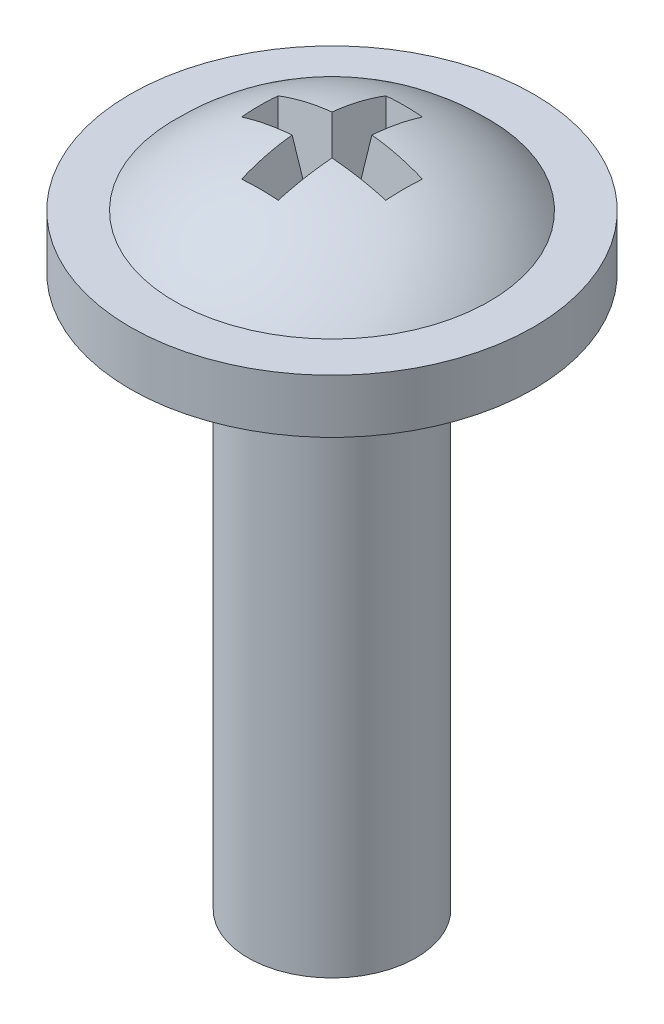
ISO-10303-21;
HEADER;
FILE_DESCRIPTION(('STEP AP214'),'2;1');
FILE_NAME('part.step','',(''),(''),'','','');
FILE_SCHEMA(('AUTOMOTIVE_DESIGN { 1 0 10303 214 1 1 1 1 }'));
ENDSEC;
DATA;
#1=APPLICATION_CONTEXT('core data for automotive mechanical design processes');
#2=APPLICATION_PROTOCOL_DEFINITION('international standard','automotive_design',2000,#1);
#3=PRODUCT_CONTEXT('',#1,'mechanical');
#4=PRODUCT('Part','Part','',(#3));
#5=PRODUCT_RELATED_PRODUCT_CATEGORY('part','',(#4));
#6=PRODUCT_DEFINITION_FORMATION('','',#4);
#7=PRODUCT_DEFINITION_CONTEXT('part definition',#1,'design');
#8=PRODUCT_DEFINITION('design','',#6,#7);
#9=PRODUCT_DEFINITION_SHAPE('','',#8);
#10=(LENGTH_UNIT() NAMED_UNIT(*) SI_UNIT(.MILLI.,.METRE.));
#11=(NAMED_UNIT(*) PLANE_ANGLE_UNIT() SI_UNIT($,.RADIAN.));
#12=(NAMED_UNIT(*) SI_UNIT($,.STERADIAN.) SOLID_ANGLE_UNIT());
#13=UNCERTAINTY_MEASURE_WITH_UNIT(LENGTH_MEASURE(1.E-05),#10,'distance_accuracy_value','');
#14=(GEOMETRIC_REPRESENTATION_CONTEXT(3) GLOBAL_UNCERTAINTY_ASSIGNED_CONTEXT((#13)) GLOBAL_UNIT_ASSIGNED_CONTEXT((#10,
#11,#12)) REPRESENTATION_CONTEXT('',''));
#15=CARTESIAN_POINT('',(0.,0.,0.));
#16=DIRECTION('',(0.,0.,1.));
#17=DIRECTION('',(1.,0.,0.));
#18=AXIS2_PLACEMENT_3D('',#15,#16,#17);
#19=CARTESIAN_POINT('',(0.,8.587994,0.));
#20=DIRECTION('',(0.,-1.,0.));
#21=DIRECTION('',(1.,0.,0.));
#22=AXIS2_PLACEMENT_3D('',#19,#20,#21);
#23=SPHERICAL_SURFACE('',#22,4.112006);
#24=CARTESIAN_POINT('',(0.,11.43,0.));
#25=DIRECTION('',(0.,-1.,0.));
#26=DIRECTION('',(0.,0.,-1.));
#27=AXIS2_PLACEMENT_3D('',#24,#25,#26);
#28=CIRCLE('',#27,2.9718);
#29=CARTESIAN_POINT('',(0.,11.43,-2.9718));
#30=VERTEX_POINT('',#29);
#31=EDGE_CURVE('E142',#30,#30,#28,.T.);
#32=ORIENTED_EDGE('',*,*,#31,.F.);
#33=EDGE_LOOP('',(#32));
#34=FACE_BOUND('',#33,.T.);
#35=CARTESIAN_POINT('',(0.,8.47510737632755,0.803230064141093));
#36=DIRECTION('',(0.,-0.139173100960066,0.99026806874157));
#37=DIRECTION('',(0.,-0.99026806874157,-0.139173100960066));
#38=AXIS2_PLACEMENT_3D('',#35,#36,#37);
#39=CIRCLE('',#38,4.03121215247867);
#40=CARTESIAN_POINT('',(-0.346193686486263,12.4523402106765,1.36219368648626));
#41=VERTEX_POINT('',#40);
#42=CARTESIAN_POINT('',(0.346193686486263,12.4523402106765,1.36219368648626));
#43=VERTEX_POINT('',#42);
#44=EDGE_CURVE('E188',#41,#43,#39,.F.);
#45=ORIENTED_EDGE('',*,*,#44,.F.);
#46=CARTESIAN_POINT('',(0.193090877395566,8.61513115308259,0.));
#47=DIRECTION('',(-0.99026806874157,-0.139173100960066,0.));
#48=DIRECTION('',(0.139173100960066,-0.99026806874157,0.));
#49=AXIS2_PLACEMENT_3D('',#46,#47,#48);
#50=CIRCLE('',#49,4.10738028821598);
#51=CARTESIAN_POINT('',(-0.376143924808765,12.6654472296146,0.376143924808762));
#52=VERTEX_POINT('',#51);
#53=EDGE_CURVE('E11',#41,#52,#50,.T.);
#54=ORIENTED_EDGE('',*,*,#53,.T.);
#55=CARTESIAN_POINT('',(0.,8.61513115308259,-0.19309087739557));
#56=DIRECTION('',(0.,-0.139173100960066,0.99026806874157));
#57=DIRECTION('',(0.,-0.99026806874157,-0.139173100960066));
#58=AXIS2_PLACEMENT_3D('',#55,#56,#57);
#59=CIRCLE('',#58,4.10738028821598);
#60=CARTESIAN_POINT('',(-1.36219368648626,12.4523402106765,0.34619368648626));
#61=VERTEX_POINT('',#60);
#62=EDGE_CURVE('E51',#61,#52,#59,.F.);
#63=ORIENTED_EDGE('',*,*,#62,.F.);
#64=CARTESIAN_POINT('',(-0.803230064141096,8.47510737632755,0.));
#65=DIRECTION('',(-0.99026806874157,-0.139173100960066,0.));
#66=DIRECTION('',(0.139173100960066,-0.99026806874157,0.));
#67=AXIS2_PLACEMENT_3D('',#64,#65,#66);
#68=CIRCLE('',#67,4.03121215247867);
#69=CARTESIAN_POINT('',(-1.36219368648626,12.4523402106765,-0.34619368648626));
#70=VERTEX_POINT('',#69);
#71=EDGE_CURVE('E210',#61,#70,#68,.T.);
#72=ORIENTED_EDGE('',*,*,#71,.T.);
#73=CARTESIAN_POINT('',(0.,8.61513115308259,0.193090877395571));
#74=DIRECTION('',(0.,-0.139173100960066,-0.99026806874157));
#75=DIRECTION('',(0.,0.99026806874157,-0.139173100960066));
#76=AXIS2_PLACEMENT_3D('',#73,#74,#75);
#77=CIRCLE('',#76,4.10738028821598);
#78=CARTESIAN_POINT('',(-0.376143924808767,12.6654472296146,-0.376143924808761));
#79=VERTEX_POINT('',#78);
#80=EDGE_CURVE('E208',#79,#70,#77,.F.);
#81=ORIENTED_EDGE('',*,*,#80,.F.);
#82=CARTESIAN_POINT('',(0.193090877395564,8.61513115308259,0.));
#83=DIRECTION('',(-0.99026806874157,-0.139173100960066,0.));
#84=DIRECTION('',(0.139173100960066,-0.99026806874157,0.));
#85=AXIS2_PLACEMENT_3D('',#82,#83,#84);
#86=CIRCLE('',#85,4.10738028821598);
#87=CARTESIAN_POINT('',(-0.346193686486261,12.4523402106765,-1.36219368648626));
#88=VERTEX_POINT('',#87);
#89=EDGE_CURVE('E205',#79,#88,#86,.T.);
#90=ORIENTED_EDGE('',*,*,#89,.T.);
#91=CARTESIAN_POINT('',(0.,8.47510737632755,-0.803230064141093));
#92=DIRECTION('',(0.,-0.139173100960066,-0.99026806874157));
#93=DIRECTION('',(0.,0.99026806874157,-0.139173100960066));
#94=AXIS2_PLACEMENT_3D('',#91,#92,#93);
#95=CIRCLE('',#94,4.03121215247867);
#96=CARTESIAN_POINT('',(0.346193686486262,12.4523402106765,-1.36219368648626));
#97=VERTEX_POINT('',#96);
#98=EDGE_CURVE('E203',#97,#88,#95,.F.);
#99=ORIENTED_EDGE('',*,*,#98,.F.);
#100=CARTESIAN_POINT('',(-0.193090877395566,8.61513115308259,0.));
#101=DIRECTION('',(0.99026806874157,-0.139173100960066,0.));
#102=DIRECTION('',(0.139173100960066,0.99026806874157,0.));
#103=AXIS2_PLACEMENT_3D('',#100,#101,#102);
#104=CIRCLE('',#103,4.10738028821598);
#105=CARTESIAN_POINT('',(0.376143924808765,12.6654472296146,-0.376143924808762));
#106=VERTEX_POINT('',#105);
#107=EDGE_CURVE('E200',#97,#106,#104,.T.);
#108=ORIENTED_EDGE('',*,*,#107,.T.);
#109=CARTESIAN_POINT('',(0.,8.61513115308259,0.19309087739557));
#110=DIRECTION('',(0.,-0.139173100960066,-0.99026806874157));
#111=DIRECTION('',(0.,0.99026806874157,-0.139173100960066));
#112=AXIS2_PLACEMENT_3D('',#109,#110,#111);
#113=CIRCLE('',#112,4.10738028821598);
#114=CARTESIAN_POINT('',(1.36219368648626,12.4523402106765,-0.34619368648626));
#115=VERTEX_POINT('',#114);
#116=EDGE_CURVE('E198',#115,#106,#113,.F.);
#117=ORIENTED_EDGE('',*,*,#116,.F.);
#118=CARTESIAN_POINT('',(0.803230064141096,8.47510737632755,0.));
#119=DIRECTION('',(0.99026806874157,-0.139173100960066,0.));
#120=DIRECTION('',(0.139173100960066,0.99026806874157,0.));
#121=AXIS2_PLACEMENT_3D('',#118,#119,#120);
#122=CIRCLE('',#121,4.03121215247867);
#123=CARTESIAN_POINT('',(1.36219368648626,12.4523402106765,0.346193686486261));
#124=VERTEX_POINT('',#123);
#125=EDGE_CURVE('E195',#115,#124,#122,.T.);
#126=ORIENTED_EDGE('',*,*,#125,.T.);
#127=CARTESIAN_POINT('',(0.,8.61513115308259,-0.193090877395571));
#128=DIRECTION('',(0.,-0.139173100960066,0.99026806874157));
#129=DIRECTION('',(0.,-0.99026806874157,-0.139173100960066));
#130=AXIS2_PLACEMENT_3D('',#127,#128,#129);
#131=CIRCLE('',#130,4.10738028821598);
#132=CARTESIAN_POINT('',(0.376143924808765,12.6654472296146,0.376143924808762));
#133=VERTEX_POINT('',#132);
#134=EDGE_CURVE('E193',#133,#124,#131,.F.);
#135=ORIENTED_EDGE('',*,*,#134,.F.);
#136=CARTESIAN_POINT('',(-0.193090877395567,8.61513115308259,0.));
#137=DIRECTION('',(0.99026806874157,-0.139173100960066,0.));
#138=DIRECTION('',(0.139173100960066,0.99026806874157,0.));
#139=AXIS2_PLACEMENT_3D('',#136,#137,#138);
#140=CIRCLE('',#139,4.10738028821598);
#141=EDGE_CURVE('E190',#133,#43,#140,.T.);
#142=ORIENTED_EDGE('',*,*,#141,.T.);
#143=EDGE_LOOP('',(#45,#54,#63,#72,#81,#90,#99,#108,#117,#126,#135,#142));
#144=FACE_BOUND('',#143,.T.);
#145=ADVANCED_FACE('F43',(#34,#144),#23,.T.);
#146=CARTESIAN_POINT('',(0.,0.,0.));
#147=DIRECTION('',(0.,-1.,0.));
#148=DIRECTION('',(0.,0.,-1.));
#149=AXIS2_PLACEMENT_3D('',#146,#147,#148);
#150=PLANE('',#149);
#151=CARTESIAN_POINT('',(0.,0.,0.));
#152=DIRECTION('',(0.,-1.,0.));
#153=DIRECTION('',(0.,0.,-1.));
#154=AXIS2_PLACEMENT_3D('',#151,#152,#153);
#155=CIRCLE('',#154,1.5875);
#156=CARTESIAN_POINT('',(0.,0.,-1.5875));
#157=VERTEX_POINT('',#156);
#158=EDGE_CURVE('E185',#157,#157,#155,.T.);
#159=ORIENTED_EDGE('',*,*,#158,.T.);
#160=EDGE_LOOP('',(#159));
#161=FACE_BOUND('',#160,.T.);
#162=ADVANCED_FACE('F45',(#161),#150,.T.);
#163=CARTESIAN_POINT('',(0.,0.,0.));
#164=DIRECTION('',(0.,-1.,0.));
#165=DIRECTION('',(0.,0.,-1.));
#166=AXIS2_PLACEMENT_3D('',#163,#164,#165);
#167=CYLINDRICAL_SURFACE('',#166,1.5875);
#168=CARTESIAN_POINT('',(0.,10.414,0.));
#169=DIRECTION('',(0.,-1.,0.));
#170=DIRECTION('',(0.,0.,-1.));
#171=AXIS2_PLACEMENT_3D('',#168,#169,#170);
#172=CIRCLE('',#171,1.5875);
#173=CARTESIAN_POINT('',(0.,10.414,-1.5875));
#174=VERTEX_POINT('',#173);
#175=EDGE_CURVE('E182',#174,#174,#172,.T.);
#176=ORIENTED_EDGE('',*,*,#175,.T.);
#177=EDGE_LOOP('',(#176));
#178=FACE_BOUND('',#177,.T.);
#179=ORIENTED_EDGE('',*,*,#158,.F.);
#180=EDGE_LOOP('',(#179));
#181=FACE_BOUND('',#180,.T.);
#182=ADVANCED_FACE('F291',(#178,#181),#167,.T.);
#183=CARTESIAN_POINT('',(1.5875,10.414,0.));
#184=DIRECTION('',(0.,-1.,0.));
#185=DIRECTION('',(0.,0.,-1.));
#186=AXIS2_PLACEMENT_3D('',#183,#184,#185);
#187=PLANE('',#186);
#188=CARTESIAN_POINT('',(0.,10.414,0.));
#189=DIRECTION('',(0.,-1.,0.));
#190=DIRECTION('',(0.,0.,-1.));
#191=AXIS2_PLACEMENT_3D('',#188,#189,#190);
#192=CIRCLE('',#191,3.81);
#193=CARTESIAN_POINT('',(0.,10.414,-3.81));
#194=VERTEX_POINT('',#193);
#195=EDGE_CURVE('E179',#194,#194,#192,.T.);
#196=ORIENTED_EDGE('',*,*,#195,.T.);
#197=EDGE_LOOP('',(#196));
#198=FACE_BOUND('',#197,.T.);
#199=ORIENTED_EDGE('',*,*,#175,.F.);
#200=EDGE_LOOP('',(#199));
#201=FACE_BOUND('',#200,.T.);
#202=ADVANCED_FACE('F303',(#198,#201),#187,.T.);
#203=CARTESIAN_POINT('',(0.,0.,0.));
#204=DIRECTION('',(0.,-1.,0.));
#205=DIRECTION('',(0.,0.,-1.));
#206=AXIS2_PLACEMENT_3D('',#203,#204,#205);
#207=CYLINDRICAL_SURFACE('',#206,3.81);
#208=CARTESIAN_POINT('',(0.,11.43,0.));
#209=DIRECTION('',(0.,-1.,0.));
#210=DIRECTION('',(0.,0.,-1.));
#211=AXIS2_PLACEMENT_3D('',#208,#209,#210);
#212=CIRCLE('',#211,3.81);
#213=CARTESIAN_POINT('',(0.,11.43,-3.81));
#214=VERTEX_POINT('',#213);
#215=EDGE_CURVE('E176',#214,#214,#212,.T.);
#216=ORIENTED_EDGE('',*,*,#215,.T.);
#217=EDGE_LOOP('',(#216));
#218=FACE_BOUND('',#217,.T.);
#219=ORIENTED_EDGE('',*,*,#195,.F.);
#220=EDGE_LOOP('',(#219));
#221=FACE_BOUND('',#220,.T.);
#222=ADVANCED_FACE('F299',(#218,#221),#207,.T.);
#223=CARTESIAN_POINT('',(3.81,11.43,0.));
#224=DIRECTION('',(0.,1.,0.));
#225=DIRECTION('',(0.,0.,1.));
#226=AXIS2_PLACEMENT_3D('',#223,#224,#225);
#227=PLANE('',#226);
#228=ORIENTED_EDGE('',*,*,#31,.T.);
#229=EDGE_LOOP('',(#228));
#230=FACE_BOUND('',#229,.T.);
#231=ORIENTED_EDGE('',*,*,#215,.F.);
#232=EDGE_LOOP('',(#231));
#233=FACE_BOUND('',#232,.T.);
#234=ADVANCED_FACE('F296',(#230,#233),#227,.T.);
#235=CARTESIAN_POINT('',(-0.381000000000002,12.7,1.397));
#236=DIRECTION('',(-0.99026806874157,-0.139173100960066,0.));
#237=DIRECTION('',(0.139173100960066,-0.99026806874157,0.));
#238=AXIS2_PLACEMENT_3D('',#235,#236,#237);
#239=PLANE('',#238);
#240=DIRECTION('',(0.137844537491629,-0.980814848463989,-0.137844537491629));
#241=VECTOR('',#240,1.);
#242=CARTESIAN_POINT('',(-0.381000000000002,12.7,1.397));
#243=LINE('',#242,#241);
#244=CARTESIAN_POINT('',(-0.0954210238847424,10.668,1.11142102388474));
#245=VERTEX_POINT('',#244);
#246=EDGE_CURVE('E58',#245,#41,#243,.F.);
#247=ORIENTED_EDGE('',*,*,#246,.F.);
#248=DIRECTION('',(0.,0.,1.));
#249=VECTOR('',#248,1.);
#250=CARTESIAN_POINT('',(-0.0954210238847421,10.668,1.397));
#251=LINE('',#250,#249);
#252=CARTESIAN_POINT('',(-0.0954210238847434,10.668,0.0954210238847397));
#253=VERTEX_POINT('',#252);
#254=EDGE_CURVE('E132',#245,#253,#251,.F.);
#255=ORIENTED_EDGE('',*,*,#254,.T.);
#256=DIRECTION('',(0.137844537491629,-0.980814848463989,-0.137844537491629));
#257=VECTOR('',#256,1.);
#258=CARTESIAN_POINT('',(-0.400305134380545,12.8373631686579,0.400305134380541));
#259=LINE('',#258,#257);
#260=EDGE_CURVE('E134',#253,#52,#259,.F.);
#261=ORIENTED_EDGE('',*,*,#260,.T.);
#262=ORIENTED_EDGE('',*,*,#53,.F.);
#263=EDGE_LOOP('',(#247,#255,#261,#262));
#264=FACE_BOUND('',#263,.T.);
#265=ADVANCED_FACE('F133',(#264),#239,.F.);
#266=CARTESIAN_POINT('',(-1.397,12.7,0.381));
#267=DIRECTION('',(0.,-0.139173100960066,0.99026806874157));
#268=DIRECTION('',(0.,-0.99026806874157,-0.139173100960066));
#269=AXIS2_PLACEMENT_3D('',#266,#267,#268);
#270=PLANE('',#269);
#271=ORIENTED_EDGE('',*,*,#62,.T.);
#272=ORIENTED_EDGE('',*,*,#260,.F.);
#273=DIRECTION('',(1.,0.,0.));
#274=VECTOR('',#273,1.);
#275=CARTESIAN_POINT('',(-1.397,10.668,0.0954210238847399));
#276=LINE('',#275,#274);
#277=CARTESIAN_POINT('',(-1.11142102388474,10.668,0.0954210238847399));
#278=VERTEX_POINT('',#277);
#279=EDGE_CURVE('E138',#278,#253,#276,.T.);
#280=ORIENTED_EDGE('',*,*,#279,.F.);
#281=DIRECTION('',(0.137844537491629,-0.980814848463989,-0.137844537491629));
#282=VECTOR('',#281,1.);
#283=CARTESIAN_POINT('',(-1.397,12.7,0.381));
#284=LINE('',#283,#282);
#285=EDGE_CURVE('E143',#278,#61,#284,.F.);
#286=ORIENTED_EDGE('',*,*,#285,.T.);
#287=EDGE_LOOP('',(#271,#272,#280,#286));
#288=FACE_BOUND('',#287,.T.);
#289=ADVANCED_FACE('F141',(#288),#270,.F.);
#290=CARTESIAN_POINT('',(-1.397,12.7,0.381));
#291=DIRECTION('',(-0.99026806874157,-0.139173100960066,0.));
#292=DIRECTION('',(0.139173100960066,-0.99026806874157,0.));
#293=AXIS2_PLACEMENT_3D('',#290,#291,#292);
#294=PLANE('',#293);
#295=ORIENTED_EDGE('',*,*,#285,.F.);
#296=DIRECTION('',(0.,0.,1.));
#297=VECTOR('',#296,1.);
#298=CARTESIAN_POINT('',(-1.11142102388474,10.668,0.381));
#299=LINE('',#298,#297);
#300=CARTESIAN_POINT('',(-1.11142102388474,10.668,-0.0954210238847392));
#301=VERTEX_POINT('',#300);
#302=EDGE_CURVE('E148',#278,#301,#299,.F.);
#303=ORIENTED_EDGE('',*,*,#302,.T.);
#304=DIRECTION('',(0.137844537491629,-0.980814848463989,0.137844537491629));
#305=VECTOR('',#304,1.);
#306=CARTESIAN_POINT('',(-1.38252114921459,12.5969776235066,-0.366521149214593));
#307=LINE('',#306,#305);
#308=EDGE_CURVE('E219',#301,#70,#307,.F.);
#309=ORIENTED_EDGE('',*,*,#308,.T.);
#310=ORIENTED_EDGE('',*,*,#71,.F.);
#311=EDGE_LOOP('',(#295,#303,#309,#310));
#312=FACE_BOUND('',#311,.T.);
#313=ADVANCED_FACE('F217',(#312),#294,.F.);
#314=CARTESIAN_POINT('',(-0.381000000000004,12.7,-0.380999999999999));
#315=DIRECTION('',(0.,-0.139173100960066,-0.99026806874157));
#316=DIRECTION('',(0.,0.99026806874157,-0.139173100960066));
#317=AXIS2_PLACEMENT_3D('',#314,#315,#316);
#318=PLANE('',#317);
#319=ORIENTED_EDGE('',*,*,#80,.T.);
#320=ORIENTED_EDGE('',*,*,#308,.F.);
#321=DIRECTION('',(-1.,0.,0.));
#322=VECTOR('',#321,1.);
#323=CARTESIAN_POINT('',(-0.381000000000004,10.668,-0.0954210238847391));
#324=LINE('',#323,#322);
#325=CARTESIAN_POINT('',(-0.095421023884745,10.668,-0.095421023884739));
#326=VERTEX_POINT('',#325);
#327=EDGE_CURVE('E150',#326,#301,#324,.T.);
#328=ORIENTED_EDGE('',*,*,#327,.F.);
#329=DIRECTION('',(0.137844537491628,-0.980814848463989,0.137844537491629));
#330=VECTOR('',#329,1.);
#331=CARTESIAN_POINT('',(-0.381000000000004,12.7,-0.380999999999999));
#332=LINE('',#331,#330);
#333=EDGE_CURVE('E220',#326,#79,#332,.F.);
#334=ORIENTED_EDGE('',*,*,#333,.T.);
#335=EDGE_LOOP('',(#319,#320,#328,#334));
#336=FACE_BOUND('',#335,.T.);
#337=ADVANCED_FACE('F276',(#336),#318,.F.);
#338=CARTESIAN_POINT('',(-0.381000000000004,12.7,-0.380999999999999));
#339=DIRECTION('',(-0.99026806874157,-0.139173100960066,0.));
#340=DIRECTION('',(0.139173100960066,-0.99026806874157,0.));
#341=AXIS2_PLACEMENT_3D('',#338,#339,#340);
#342=PLANE('',#341);
#343=ORIENTED_EDGE('',*,*,#333,.F.);
#344=DIRECTION('',(0.,0.,1.));
#345=VECTOR('',#344,1.);
#346=CARTESIAN_POINT('',(-0.095421023884744,10.668,-0.380999999999998));
#347=LINE('',#346,#345);
#348=CARTESIAN_POINT('',(-0.0954210238847412,10.668,-1.11142102388474));
#349=VERTEX_POINT('',#348);
#350=EDGE_CURVE('E155',#326,#349,#347,.F.);
#351=ORIENTED_EDGE('',*,*,#350,.T.);
#352=DIRECTION('',(0.137844537491628,-0.980814848463989,0.137844537491629));
#353=VECTOR('',#352,1.);
#354=CARTESIAN_POINT('',(-0.361694865619459,12.5626368313421,-1.37769486561945));
#355=LINE('',#354,#353);
#356=EDGE_CURVE('E225',#349,#88,#355,.F.);
#357=ORIENTED_EDGE('',*,*,#356,.T.);
#358=ORIENTED_EDGE('',*,*,#89,.F.);
#359=EDGE_LOOP('',(#343,#351,#357,#358));
#360=FACE_BOUND('',#359,.T.);
#361=ADVANCED_FACE('F272',(#360),#342,.F.);
#362=CARTESIAN_POINT('',(0.381000000000001,12.7,-1.397));
#363=DIRECTION('',(0.,-0.139173100960066,-0.99026806874157));
#364=DIRECTION('',(0.,0.99026806874157,-0.139173100960066));
#365=AXIS2_PLACEMENT_3D('',#362,#363,#364);
#366=PLANE('',#365);
#367=ORIENTED_EDGE('',*,*,#98,.T.);
#368=ORIENTED_EDGE('',*,*,#356,.F.);
#369=DIRECTION('',(-1.,0.,0.));
#370=VECTOR('',#369,1.);
#371=CARTESIAN_POINT('',(0.381000000000001,10.668,-1.11142102388474));
#372=LINE('',#371,#370);
#373=CARTESIAN_POINT('',(0.0954210238847415,10.668,-1.11142102388474));
#374=VERTEX_POINT('',#373);
#375=EDGE_CURVE('E157',#374,#349,#372,.T.);
#376=ORIENTED_EDGE('',*,*,#375,.F.);
#377=DIRECTION('',(-0.137844537491629,-0.980814848463989,0.137844537491629));
#378=VECTOR('',#377,1.);
#379=CARTESIAN_POINT('',(0.381000000000001,12.7,-1.397));
#380=LINE('',#379,#378);
#381=EDGE_CURVE('E228',#374,#97,#380,.F.);
#382=ORIENTED_EDGE('',*,*,#381,.T.);
#383=EDGE_LOOP('',(#367,#368,#376,#382));
#384=FACE_BOUND('',#383,.T.);
#385=ADVANCED_FACE('F269',(#384),#366,.F.);
#386=CARTESIAN_POINT('',(0.381000000000001,12.7,-1.397));
#387=DIRECTION('',(0.99026806874157,-0.139173100960066,0.));
#388=DIRECTION('',(0.139173100960066,0.99026806874157,0.));
#389=AXIS2_PLACEMENT_3D('',#386,#387,#388);
#390=PLANE('',#389);
#391=ORIENTED_EDGE('',*,*,#381,.F.);
#392=DIRECTION('',(0.,0.,-1.));
#393=VECTOR('',#392,1.);
#394=CARTESIAN_POINT('',(0.095421023884741,10.668,-1.397));
#395=LINE('',#394,#393);
#396=CARTESIAN_POINT('',(0.0954210238847431,10.668,-0.0954210238847393));
#397=VERTEX_POINT('',#396);
#398=EDGE_CURVE('E160',#374,#397,#395,.F.);
#399=ORIENTED_EDGE('',*,*,#398,.T.);
#400=DIRECTION('',(-0.137844537491629,-0.980814848463989,0.137844537491629));
#401=VECTOR('',#400,1.);
#402=CARTESIAN_POINT('',(0.400305134380544,12.8373631686579,-0.400305134380541));
#403=LINE('',#402,#401);
#404=EDGE_CURVE('E231',#397,#106,#403,.F.);
#405=ORIENTED_EDGE('',*,*,#404,.T.);
#406=ORIENTED_EDGE('',*,*,#107,.F.);
#407=EDGE_LOOP('',(#391,#399,#405,#406));
#408=FACE_BOUND('',#407,.T.);
#409=ADVANCED_FACE('F265',(#408),#390,.F.);
#410=CARTESIAN_POINT('',(1.397,12.7,-0.380999999999999));
#411=DIRECTION('',(0.,-0.139173100960066,-0.99026806874157));
#412=DIRECTION('',(0.,0.99026806874157,-0.139173100960066));
#413=AXIS2_PLACEMENT_3D('',#410,#411,#412);
#414=PLANE('',#413);
#415=ORIENTED_EDGE('',*,*,#116,.T.);
#416=ORIENTED_EDGE('',*,*,#404,.F.);
#417=DIRECTION('',(-1.,0.,0.));
#418=VECTOR('',#417,1.);
#419=CARTESIAN_POINT('',(1.397,10.668,-0.0954210238847393));
#420=LINE('',#419,#418);
#421=CARTESIAN_POINT('',(1.11142102388474,10.668,-0.0954210238847393));
#422=VERTEX_POINT('',#421);
#423=EDGE_CURVE('E162',#422,#397,#420,.T.);
#424=ORIENTED_EDGE('',*,*,#423,.F.);
#425=DIRECTION('',(-0.137844537491629,-0.980814848463989,0.137844537491629));
#426=VECTOR('',#425,1.);
#427=CARTESIAN_POINT('',(1.397,12.7,-0.380999999999999));
#428=LINE('',#427,#426);
#429=EDGE_CURVE('E234',#422,#115,#428,.F.);
#430=ORIENTED_EDGE('',*,*,#429,.T.);
#431=EDGE_LOOP('',(#415,#416,#424,#430));
#432=FACE_BOUND('',#431,.T.);
#433=ADVANCED_FACE('F263',(#432),#414,.F.);
#434=CARTESIAN_POINT('',(1.397,12.7,-0.380999999999999));
#435=DIRECTION('',(0.99026806874157,-0.139173100960066,0.));
#436=DIRECTION('',(0.139173100960066,0.99026806874157,0.));
#437=AXIS2_PLACEMENT_3D('',#434,#435,#436);
#438=PLANE('',#437);
#439=ORIENTED_EDGE('',*,*,#429,.F.);
#440=DIRECTION('',(0.,0.,-1.));
#441=VECTOR('',#440,1.);
#442=CARTESIAN_POINT('',(1.11142102388474,10.668,-0.380999999999999));
#443=LINE('',#442,#441);
#444=CARTESIAN_POINT('',(1.11142102388474,10.668,0.0954210238847406));
#445=VERTEX_POINT('',#444);
#446=EDGE_CURVE('E165',#422,#445,#443,.F.);
#447=ORIENTED_EDGE('',*,*,#446,.T.);
#448=DIRECTION('',(-0.137844537491629,-0.980814848463989,-0.137844537491629));
#449=VECTOR('',#448,1.);
#450=CARTESIAN_POINT('',(1.38252114921459,12.5969776235066,0.366521149214595));
#451=LINE('',#450,#449);
#452=EDGE_CURVE('E237',#445,#124,#451,.F.);
#453=ORIENTED_EDGE('',*,*,#452,.T.);
#454=ORIENTED_EDGE('',*,*,#125,.F.);
#455=EDGE_LOOP('',(#439,#447,#453,#454));
#456=FACE_BOUND('',#455,.T.);
#457=ADVANCED_FACE('F257',(#456),#438,.F.);
#458=CARTESIAN_POINT('',(0.381000000000003,12.7,0.380999999999999));
#459=DIRECTION('',(0.,-0.139173100960066,0.99026806874157));
#460=DIRECTION('',(0.,-0.99026806874157,-0.139173100960066));
#461=AXIS2_PLACEMENT_3D('',#458,#459,#460);
#462=PLANE('',#461);
#463=ORIENTED_EDGE('',*,*,#134,.T.);
#464=ORIENTED_EDGE('',*,*,#452,.F.);
#465=DIRECTION('',(1.,0.,0.));
#466=VECTOR('',#465,1.);
#467=CARTESIAN_POINT('',(0.381000000000003,10.668,0.0954210238847395));
#468=LINE('',#467,#466);
#469=CARTESIAN_POINT('',(0.0954210238847429,10.668,0.0954210238847391));
#470=VERTEX_POINT('',#469);
#471=EDGE_CURVE('E167',#470,#445,#468,.T.);
#472=ORIENTED_EDGE('',*,*,#471,.F.);
#473=DIRECTION('',(-0.137844537491629,-0.980814848463989,-0.137844537491629));
#474=VECTOR('',#473,1.);
#475=CARTESIAN_POINT('',(0.381000000000003,12.7,0.380999999999999));
#476=LINE('',#475,#474);
#477=EDGE_CURVE('E240',#470,#133,#476,.F.);
#478=ORIENTED_EDGE('',*,*,#477,.T.);
#479=EDGE_LOOP('',(#463,#464,#472,#478));
#480=FACE_BOUND('',#479,.T.);
#481=ADVANCED_FACE('F254',(#480),#462,.F.);
#482=CARTESIAN_POINT('',(0.381000000000003,12.7,0.380999999999999));
#483=DIRECTION('',(0.99026806874157,-0.139173100960066,0.));
#484=DIRECTION('',(0.139173100960066,0.99026806874157,0.));
#485=AXIS2_PLACEMENT_3D('',#482,#483,#484);
#486=PLANE('',#485);
#487=ORIENTED_EDGE('',*,*,#477,.F.);
#488=DIRECTION('',(0.,0.,-1.));
#489=VECTOR('',#488,1.);
#490=CARTESIAN_POINT('',(0.0954210238847428,10.668,0.380999999999999));
#491=LINE('',#490,#489);
#492=CARTESIAN_POINT('',(0.0954210238847423,10.668,1.11142102388474));
#493=VERTEX_POINT('',#492);
#494=EDGE_CURVE('E170',#470,#493,#491,.F.);
#495=ORIENTED_EDGE('',*,*,#494,.T.);
#496=DIRECTION('',(-0.137844537491629,-0.980814848463989,-0.137844537491629));
#497=VECTOR('',#496,1.);
#498=CARTESIAN_POINT('',(0.361694865619461,12.5626368313421,1.37769486561945));
#499=LINE('',#498,#497);
#500=EDGE_CURVE('E243',#493,#43,#499,.F.);
#501=ORIENTED_EDGE('',*,*,#500,.T.);
#502=ORIENTED_EDGE('',*,*,#141,.F.);
#503=EDGE_LOOP('',(#487,#495,#501,#502));
#504=FACE_BOUND('',#503,.T.);
#505=ADVANCED_FACE('F248',(#504),#486,.F.);
#506=CARTESIAN_POINT('',(-0.381000000000002,12.7,1.397));
#507=DIRECTION('',(0.,-0.139173100960066,0.99026806874157));
#508=DIRECTION('',(0.,-0.99026806874157,-0.139173100960066));
#509=AXIS2_PLACEMENT_3D('',#506,#507,#508);
#510=PLANE('',#509);
#511=ORIENTED_EDGE('',*,*,#44,.T.);
#512=ORIENTED_EDGE('',*,*,#500,.F.);
#513=DIRECTION('',(1.,0.,0.));
#514=VECTOR('',#513,1.);
#515=CARTESIAN_POINT('',(-0.381000000000002,10.668,1.11142102388474));
#516=LINE('',#515,#514);
#517=EDGE_CURVE('E172',#245,#493,#516,.T.);
#518=ORIENTED_EDGE('',*,*,#517,.F.);
#519=ORIENTED_EDGE('',*,*,#246,.T.);
#520=EDGE_LOOP('',(#511,#512,#518,#519));
#521=FACE_BOUND('',#520,.T.);
#522=ADVANCED_FACE('F403',(#521),#510,.F.);
#523=CARTESIAN_POINT('',(-0.381000000000003,10.668,0.381));
#524=DIRECTION('',(0.,-1.,0.));
#525=DIRECTION('',(0.,0.,-1.));
#526=AXIS2_PLACEMENT_3D('',#523,#524,#525);
#527=PLANE('',#526);
#528=ORIENTED_EDGE('',*,*,#254,.F.);
#529=ORIENTED_EDGE('',*,*,#517,.T.);
#530=ORIENTED_EDGE('',*,*,#494,.F.);
#531=ORIENTED_EDGE('',*,*,#471,.T.);
#532=ORIENTED_EDGE('',*,*,#446,.F.);
#533=ORIENTED_EDGE('',*,*,#423,.T.);
#534=ORIENTED_EDGE('',*,*,#398,.F.);
#535=ORIENTED_EDGE('',*,*,#375,.T.);
#536=ORIENTED_EDGE('',*,*,#350,.F.);
#537=ORIENTED_EDGE('',*,*,#327,.T.);
#538=ORIENTED_EDGE('',*,*,#302,.F.);
#539=ORIENTED_EDGE('',*,*,#279,.T.);
#540=EDGE_LOOP('',(#528,#529,#530,#531,#532,#533,#534,#535,#536,#537,#538,#539));
#541=FACE_BOUND('',#540,.T.);
#542=ADVANCED_FACE('F146',(#541),#527,.F.);
#543=CLOSED_SHELL('',(#145,#162,#182,#202,#222,#234,#265,#289,#313,#337,#361,#385,#409,#433,
#457,#481,#505,#522,#542));
#544=MANIFOLD_SOLID_BREP('B2',#543);
#545=ADVANCED_BREP_SHAPE_REPRESENTATION('',(#18,#544),#14);
#546=SHAPE_DEFINITION_REPRESENTATION(#9,#545);
ENDSEC;
END-ISO-10303-21;
